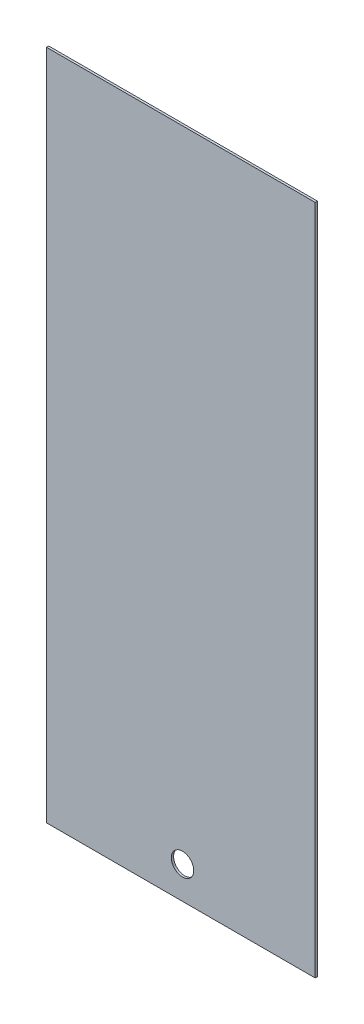
ISO-10303-21;
HEADER;
FILE_DESCRIPTION(('STEP AP214'),'2;1');
FILE_NAME('part.step','',(''),(''),'','','');
FILE_SCHEMA(('AUTOMOTIVE_DESIGN { 1 0 10303 214 1 1 1 1 }'));
ENDSEC;
DATA;
#1=APPLICATION_CONTEXT('core data for automotive mechanical design processes');
#2=APPLICATION_PROTOCOL_DEFINITION('international standard','automotive_design',2000,#1);
#3=PRODUCT_CONTEXT('',#1,'mechanical');
#4=PRODUCT('Part','Part','',(#3));
#5=PRODUCT_RELATED_PRODUCT_CATEGORY('part','',(#4));
#6=PRODUCT_DEFINITION_FORMATION('','',#4);
#7=PRODUCT_DEFINITION_CONTEXT('part definition',#1,'design');
#8=PRODUCT_DEFINITION('design','',#6,#7);
#9=PRODUCT_DEFINITION_SHAPE('','',#8);
#10=(LENGTH_UNIT() NAMED_UNIT(*) SI_UNIT(.MILLI.,.METRE.));
#11=(NAMED_UNIT(*) PLANE_ANGLE_UNIT() SI_UNIT($,.RADIAN.));
#12=(NAMED_UNIT(*) SI_UNIT($,.STERADIAN.) SOLID_ANGLE_UNIT());
#13=UNCERTAINTY_MEASURE_WITH_UNIT(LENGTH_MEASURE(1.E-05),#10,'distance_accuracy_value','');
#14=(GEOMETRIC_REPRESENTATION_CONTEXT(3) GLOBAL_UNCERTAINTY_ASSIGNED_CONTEXT((#13)) GLOBAL_UNIT_ASSIGNED_CONTEXT((#10,
#11,#12)) REPRESENTATION_CONTEXT('',''));
#15=CARTESIAN_POINT('',(0.,0.,0.));
#16=DIRECTION('',(0.,0.,1.));
#17=DIRECTION('',(1.,0.,0.));
#18=AXIS2_PLACEMENT_3D('',#15,#16,#17);
#19=CARTESIAN_POINT('',(-177.468407310705,180.253785900783,2.54));
#20=DIRECTION('',(1.,0.,0.));
#21=DIRECTION('',(0.,1.,0.));
#22=AXIS2_PLACEMENT_3D('',#19,#20,#21);
#23=PLANE('',#22);
#24=DIRECTION('',(0.,-1.,0.));
#25=VECTOR('',#24,1.);
#26=CARTESIAN_POINT('',(-177.468407310705,180.253785900783,0.));
#27=LINE('',#26,#25);
#28=CARTESIAN_POINT('',(-177.468407310705,180.253785900783,0.));
#29=VERTEX_POINT('',#28);
#30=CARTESIAN_POINT('',(-177.468407310705,-581.746214099217,0.));
#31=VERTEX_POINT('',#30);
#32=EDGE_CURVE('E95',#29,#31,#27,.T.);
#33=ORIENTED_EDGE('',*,*,#32,.T.);
#34=DIRECTION('',(0.,0.,-1.));
#35=VECTOR('',#34,1.);
#36=CARTESIAN_POINT('',(-177.468407310705,-581.746214099217,2.54));
#37=LINE('',#36,#35);
#38=CARTESIAN_POINT('',(-177.468407310705,-581.746214099217,2.54));
#39=VERTEX_POINT('',#38);
#40=EDGE_CURVE('E11',#39,#31,#37,.T.);
#41=ORIENTED_EDGE('',*,*,#40,.F.);
#42=DIRECTION('',(0.,-1.,0.));
#43=VECTOR('',#42,1.);
#44=CARTESIAN_POINT('',(-177.468407310705,180.253785900783,2.54));
#45=LINE('',#44,#43);
#46=CARTESIAN_POINT('',(-177.468407310705,180.253785900783,2.54));
#47=VERTEX_POINT('',#46);
#48=EDGE_CURVE('E83',#47,#39,#45,.T.);
#49=ORIENTED_EDGE('',*,*,#48,.F.);
#50=DIRECTION('',(0.,0.,-1.));
#51=VECTOR('',#50,1.);
#52=CARTESIAN_POINT('',(-177.468407310705,180.253785900783,2.54));
#53=LINE('',#52,#51);
#54=EDGE_CURVE('E91',#47,#29,#53,.T.);
#55=ORIENTED_EDGE('',*,*,#54,.T.);
#56=EDGE_LOOP('',(#33,#41,#49,#55));
#57=FACE_BOUND('',#56,.T.);
#58=ADVANCED_FACE('F32',(#57),#23,.F.);
#59=CARTESIAN_POINT('',(-177.468407310705,-581.746214099217,2.54));
#60=DIRECTION('',(0.,1.,0.));
#61=DIRECTION('',(0.,0.,1.));
#62=AXIS2_PLACEMENT_3D('',#59,#60,#61);
#63=PLANE('',#62);
#64=DIRECTION('',(1.,0.,0.));
#65=VECTOR('',#64,1.);
#66=CARTESIAN_POINT('',(-177.468407310705,-581.746214099217,0.));
#67=LINE('',#66,#65);
#68=CARTESIAN_POINT('',(127.331592689295,-581.746214099217,0.));
#69=VERTEX_POINT('',#68);
#70=EDGE_CURVE('E87',#31,#69,#67,.T.);
#71=ORIENTED_EDGE('',*,*,#70,.T.);
#72=DIRECTION('',(0.,0.,-1.));
#73=VECTOR('',#72,1.);
#74=CARTESIAN_POINT('',(127.331592689295,-581.746214099217,2.54));
#75=LINE('',#74,#73);
#76=CARTESIAN_POINT('',(127.331592689295,-581.746214099217,2.54));
#77=VERTEX_POINT('',#76);
#78=EDGE_CURVE('E40',#77,#69,#75,.T.);
#79=ORIENTED_EDGE('',*,*,#78,.F.);
#80=DIRECTION('',(1.,0.,0.));
#81=VECTOR('',#80,1.);
#82=CARTESIAN_POINT('',(-177.468407310705,-581.746214099217,2.54));
#83=LINE('',#82,#81);
#84=EDGE_CURVE('E78',#39,#77,#83,.T.);
#85=ORIENTED_EDGE('',*,*,#84,.F.);
#86=ORIENTED_EDGE('',*,*,#40,.T.);
#87=EDGE_LOOP('',(#71,#79,#85,#86));
#88=FACE_BOUND('',#87,.T.);
#89=ADVANCED_FACE('F86',(#88),#63,.F.);
#90=CARTESIAN_POINT('',(127.331592689295,180.253785900783,2.54));
#91=DIRECTION('',(-1.,0.,0.));
#92=DIRECTION('',(0.,-1.,0.));
#93=AXIS2_PLACEMENT_3D('',#90,#91,#92);
#94=PLANE('',#93);
#95=DIRECTION('',(0.,1.,0.));
#96=VECTOR('',#95,1.);
#97=CARTESIAN_POINT('',(127.331592689295,180.253785900783,0.));
#98=LINE('',#97,#96);
#99=CARTESIAN_POINT('',(127.331592689295,180.253785900783,0.));
#100=VERTEX_POINT('',#99);
#101=EDGE_CURVE('E65',#69,#100,#98,.T.);
#102=ORIENTED_EDGE('',*,*,#101,.T.);
#103=DIRECTION('',(0.,0.,-1.));
#104=VECTOR('',#103,1.);
#105=CARTESIAN_POINT('',(127.331592689295,180.253785900783,2.54));
#106=LINE('',#105,#104);
#107=CARTESIAN_POINT('',(127.331592689295,180.253785900783,2.54));
#108=VERTEX_POINT('',#107);
#109=EDGE_CURVE('E88',#108,#100,#106,.T.);
#110=ORIENTED_EDGE('',*,*,#109,.F.);
#111=DIRECTION('',(0.,1.,0.));
#112=VECTOR('',#111,1.);
#113=CARTESIAN_POINT('',(127.331592689295,180.253785900783,2.54));
#114=LINE('',#113,#112);
#115=EDGE_CURVE('E81',#77,#108,#114,.T.);
#116=ORIENTED_EDGE('',*,*,#115,.F.);
#117=ORIENTED_EDGE('',*,*,#78,.T.);
#118=EDGE_LOOP('',(#102,#110,#116,#117));
#119=FACE_BOUND('',#118,.T.);
#120=ADVANCED_FACE('F89',(#119),#94,.F.);
#121=CARTESIAN_POINT('',(-177.468407310705,180.253785900783,2.54));
#122=DIRECTION('',(0.,-1.,0.));
#123=DIRECTION('',(0.,0.,-1.));
#124=AXIS2_PLACEMENT_3D('',#121,#122,#123);
#125=PLANE('',#124);
#126=DIRECTION('',(-1.,0.,0.));
#127=VECTOR('',#126,1.);
#128=CARTESIAN_POINT('',(-177.468407310705,180.253785900783,0.));
#129=LINE('',#128,#127);
#130=EDGE_CURVE('E71',#100,#29,#129,.T.);
#131=ORIENTED_EDGE('',*,*,#130,.T.);
#132=ORIENTED_EDGE('',*,*,#54,.F.);
#133=DIRECTION('',(-1.,0.,0.));
#134=VECTOR('',#133,1.);
#135=CARTESIAN_POINT('',(-177.468407310705,180.253785900783,2.54));
#136=LINE('',#135,#134);
#137=EDGE_CURVE('E48',#108,#47,#136,.T.);
#138=ORIENTED_EDGE('',*,*,#137,.F.);
#139=ORIENTED_EDGE('',*,*,#109,.T.);
#140=EDGE_LOOP('',(#131,#132,#138,#139));
#141=FACE_BOUND('',#140,.T.);
#142=ADVANCED_FACE('F103',(#141),#125,.F.);
#143=CARTESIAN_POINT('',(0.,0.,2.54));
#144=DIRECTION('',(0.,0.,1.));
#145=DIRECTION('',(1.,0.,0.));
#146=AXIS2_PLACEMENT_3D('',#143,#144,#145);
#147=PLANE('',#146);
#148=CARTESIAN_POINT('',(-23.1931932312567,-545.162860091337,2.54));
#149=DIRECTION('',(0.,0.,1.));
#150=DIRECTION('',(1.,0.,0.));
#151=AXIS2_PLACEMENT_3D('',#148,#149,#150);
#152=CIRCLE('',#151,12.7);
#153=CARTESIAN_POINT('',(-10.4931932312567,-545.162860091337,2.54));
#154=VERTEX_POINT('',#153);
#155=EDGE_CURVE('E109',#154,#154,#152,.T.);
#156=ORIENTED_EDGE('',*,*,#155,.F.);
#157=EDGE_LOOP('',(#156));
#158=FACE_BOUND('',#157,.T.);
#159=ORIENTED_EDGE('',*,*,#48,.T.);
#160=ORIENTED_EDGE('',*,*,#84,.T.);
#161=ORIENTED_EDGE('',*,*,#115,.T.);
#162=ORIENTED_EDGE('',*,*,#137,.T.);
#163=EDGE_LOOP('',(#159,#160,#161,#162));
#164=FACE_BOUND('',#163,.T.);
#165=ADVANCED_FACE('F79',(#158,#164),#147,.T.);
#166=CARTESIAN_POINT('',(0.,0.,0.));
#167=DIRECTION('',(0.,0.,1.));
#168=DIRECTION('',(1.,0.,0.));
#169=AXIS2_PLACEMENT_3D('',#166,#167,#168);
#170=PLANE('',#169);
#171=CARTESIAN_POINT('',(-23.1931932312567,-545.162860091337,0.));
#172=DIRECTION('',(0.,0.,1.));
#173=DIRECTION('',(1.,0.,0.));
#174=AXIS2_PLACEMENT_3D('',#171,#172,#173);
#175=CIRCLE('',#174,12.7);
#176=CARTESIAN_POINT('',(-10.4931932312567,-545.162860091337,0.));
#177=VERTEX_POINT('',#176);
#178=EDGE_CURVE('E98',#177,#177,#175,.T.);
#179=ORIENTED_EDGE('',*,*,#178,.T.);
#180=EDGE_LOOP('',(#179));
#181=FACE_BOUND('',#180,.T.);
#182=ORIENTED_EDGE('',*,*,#32,.F.);
#183=ORIENTED_EDGE('',*,*,#130,.F.);
#184=ORIENTED_EDGE('',*,*,#101,.F.);
#185=ORIENTED_EDGE('',*,*,#70,.F.);
#186=EDGE_LOOP('',(#182,#183,#184,#185));
#187=FACE_BOUND('',#186,.T.);
#188=ADVANCED_FACE('F106',(#181,#187),#170,.F.);
#189=CARTESIAN_POINT('',(-23.1931932312567,-545.162860091337,0.));
#190=DIRECTION('',(0.,0.,1.));
#191=DIRECTION('',(1.,0.,0.));
#192=AXIS2_PLACEMENT_3D('',#189,#190,#191);
#193=CYLINDRICAL_SURFACE('',#192,12.7);
#194=ORIENTED_EDGE('',*,*,#178,.F.);
#195=EDGE_LOOP('',(#194));
#196=FACE_BOUND('',#195,.T.);
#197=ORIENTED_EDGE('',*,*,#155,.T.);
#198=EDGE_LOOP('',(#197));
#199=FACE_BOUND('',#198,.T.);
#200=ADVANCED_FACE('F116',(#196,#199),#193,.F.);
#201=CLOSED_SHELL('',(#58,#89,#120,#142,#165,#188,#200));
#202=MANIFOLD_SOLID_BREP('B2',#201);
#203=ADVANCED_BREP_SHAPE_REPRESENTATION('',(#18,#202),#14);
#204=SHAPE_DEFINITION_REPRESENTATION(#9,#203);
ENDSEC;
END-ISO-10303-21;
